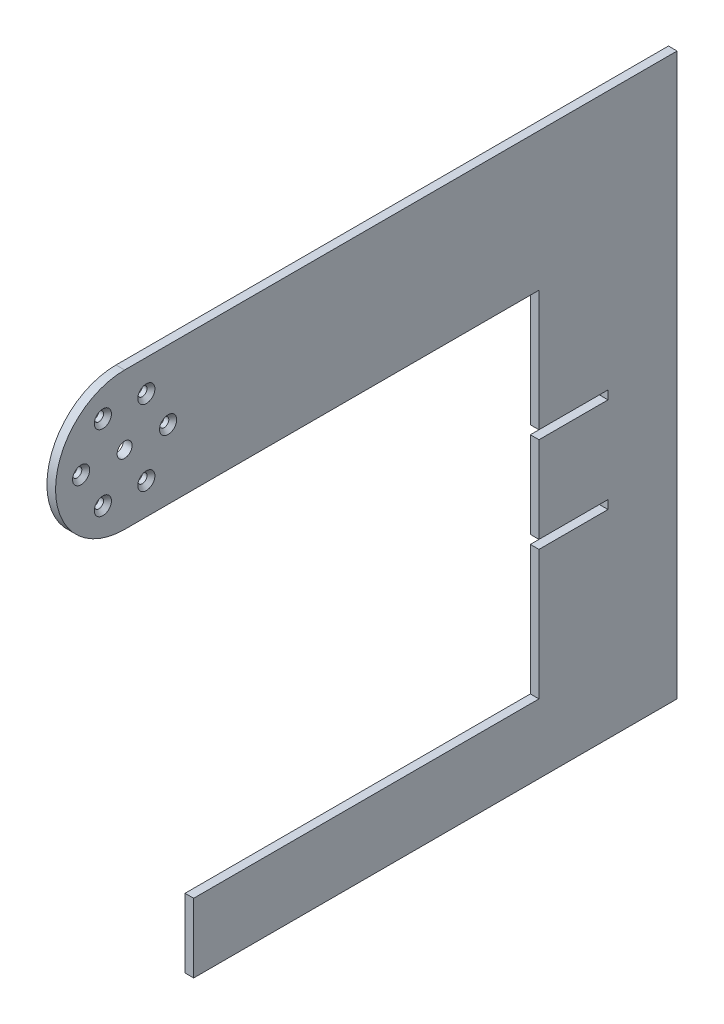
ISO-10303-21;
HEADER;
FILE_DESCRIPTION(('STEP AP214'),'2;1');
FILE_NAME('part.step','',(''),(''),'','','');
FILE_SCHEMA(('AUTOMOTIVE_DESIGN { 1 0 10303 214 1 1 1 1 }'));
ENDSEC;
DATA;
#1=APPLICATION_CONTEXT('core data for automotive mechanical design processes');
#2=APPLICATION_PROTOCOL_DEFINITION('international standard','automotive_design',2000,#1);
#3=PRODUCT_CONTEXT('',#1,'mechanical');
#4=PRODUCT('Part','Part','',(#3));
#5=PRODUCT_RELATED_PRODUCT_CATEGORY('part','',(#4));
#6=PRODUCT_DEFINITION_FORMATION('','',#4);
#7=PRODUCT_DEFINITION_CONTEXT('part definition',#1,'design');
#8=PRODUCT_DEFINITION('design','',#6,#7);
#9=PRODUCT_DEFINITION_SHAPE('','',#8);
#10=(LENGTH_UNIT() NAMED_UNIT(*) SI_UNIT(.MILLI.,.METRE.));
#11=(NAMED_UNIT(*) PLANE_ANGLE_UNIT() SI_UNIT($,.RADIAN.));
#12=(NAMED_UNIT(*) SI_UNIT($,.STERADIAN.) SOLID_ANGLE_UNIT());
#13=UNCERTAINTY_MEASURE_WITH_UNIT(LENGTH_MEASURE(1.E-05),#10,'distance_accuracy_value','');
#14=(GEOMETRIC_REPRESENTATION_CONTEXT(3) GLOBAL_UNCERTAINTY_ASSIGNED_CONTEXT((#13)) GLOBAL_UNIT_ASSIGNED_CONTEXT((#10,
#11,#12)) REPRESENTATION_CONTEXT('',''));
#15=CARTESIAN_POINT('',(0.,0.,0.));
#16=DIRECTION('',(0.,0.,1.));
#17=DIRECTION('',(1.,0.,0.));
#18=AXIS2_PLACEMENT_3D('',#15,#16,#17);
#19=CARTESIAN_POINT('',(-3.175,52.3875,50.8));
#20=DIRECTION('',(0.,0.,1.));
#21=DIRECTION('',(0.,-1.,0.));
#22=AXIS2_PLACEMENT_3D('',#19,#20,#21);
#23=PLANE('',#22);
#24=DIRECTION('',(1.,0.,0.));
#25=VECTOR('',#24,1.);
#26=CARTESIAN_POINT('',(-3.175,7.93750000000001,50.8));
#27=LINE('',#26,#25);
#28=CARTESIAN_POINT('',(-3.175,7.93750000000001,50.8));
#29=VERTEX_POINT('',#28);
#30=CARTESIAN_POINT('',(0.,7.93750000000001,50.8));
#31=VERTEX_POINT('',#30);
#32=EDGE_CURVE('E206',#29,#31,#27,.T.);
#33=ORIENTED_EDGE('',*,*,#32,.T.);
#34=DIRECTION('',(0.,-1.,0.));
#35=VECTOR('',#34,1.);
#36=CARTESIAN_POINT('',(0.,52.3875,50.8));
#37=LINE('',#36,#35);
#38=CARTESIAN_POINT('',(0.,52.3875,50.8));
#39=VERTEX_POINT('',#38);
#40=EDGE_CURVE('E213',#39,#31,#37,.T.);
#41=ORIENTED_EDGE('',*,*,#40,.F.);
#42=DIRECTION('',(1.,0.,0.));
#43=VECTOR('',#42,1.);
#44=CARTESIAN_POINT('',(-3.175,52.3875,50.8));
#45=LINE('',#44,#43);
#46=CARTESIAN_POINT('',(-3.175,52.3875,50.8));
#47=VERTEX_POINT('',#46);
#48=EDGE_CURVE('E238',#47,#39,#45,.T.);
#49=ORIENTED_EDGE('',*,*,#48,.F.);
#50=DIRECTION('',(0.,-1.,0.));
#51=VECTOR('',#50,1.);
#52=CARTESIAN_POINT('',(-3.175,52.3875,50.8));
#53=LINE('',#52,#51);
#54=EDGE_CURVE('E183',#47,#29,#53,.T.);
#55=ORIENTED_EDGE('',*,*,#54,.T.);
#56=EDGE_LOOP('',(#33,#41,#49,#55));
#57=FACE_BOUND('',#56,.T.);
#58=ADVANCED_FACE('F44',(#57),#23,.T.);
#59=DIRECTION('',(1.,0.,0.));
#60=VECTOR('',#59,1.);
#61=CARTESIAN_POINT('',(-3.175,4.76250000000001,50.8));
#62=LINE('',#61,#60);
#63=CARTESIAN_POINT('',(-3.175,4.76250000000001,50.8));
#64=VERTEX_POINT('',#63);
#65=CARTESIAN_POINT('',(0.,4.7625,50.8));
#66=VERTEX_POINT('',#65);
#67=EDGE_CURVE('E69',#64,#66,#62,.T.);
#68=ORIENTED_EDGE('',*,*,#67,.F.);
#69=CARTESIAN_POINT('',(-3.175,-26.9875,50.8));
#70=VERTEX_POINT('',#69);
#71=EDGE_CURVE('E173',#64,#70,#53,.T.);
#72=ORIENTED_EDGE('',*,*,#71,.T.);
#73=DIRECTION('',(1.,0.,0.));
#74=VECTOR('',#73,1.);
#75=CARTESIAN_POINT('',(-3.175,-26.9875,50.8));
#76=LINE('',#75,#74);
#77=CARTESIAN_POINT('',(0.,-26.9875,50.8));
#78=VERTEX_POINT('',#77);
#79=EDGE_CURVE('E277',#70,#78,#76,.T.);
#80=ORIENTED_EDGE('',*,*,#79,.T.);
#81=EDGE_CURVE('E175',#66,#78,#37,.T.);
#82=ORIENTED_EDGE('',*,*,#81,.F.);
#83=EDGE_LOOP('',(#68,#72,#80,#82));
#84=FACE_BOUND('',#83,.T.);
#85=ADVANCED_FACE('F171',(#84),#23,.T.);
#86=CARTESIAN_POINT('',(-3.175,103.1875,0.));
#87=DIRECTION('',(0.,1.,0.));
#88=DIRECTION('',(0.,0.,1.));
#89=AXIS2_PLACEMENT_3D('',#86,#87,#88);
#90=PLANE('',#89);
#91=DIRECTION('',(0.,0.,1.));
#92=VECTOR('',#91,1.);
#93=CARTESIAN_POINT('',(0.,103.1875,0.));
#94=LINE('',#93,#92);
#95=CARTESIAN_POINT('',(0.,103.1875,0.));
#96=VERTEX_POINT('',#95);
#97=CARTESIAN_POINT('',(0.,103.1875,203.2));
#98=VERTEX_POINT('',#97);
#99=EDGE_CURVE('E202',#96,#98,#94,.T.);
#100=ORIENTED_EDGE('',*,*,#99,.F.);
#101=DIRECTION('',(1.,0.,0.));
#102=VECTOR('',#101,1.);
#103=CARTESIAN_POINT('',(-3.175,103.1875,0.));
#104=LINE('',#103,#102);
#105=CARTESIAN_POINT('',(-3.175,103.1875,0.));
#106=VERTEX_POINT('',#105);
#107=EDGE_CURVE('E11',#106,#96,#104,.T.);
#108=ORIENTED_EDGE('',*,*,#107,.F.);
#109=DIRECTION('',(0.,0.,1.));
#110=VECTOR('',#109,1.);
#111=CARTESIAN_POINT('',(-3.175,103.1875,0.));
#112=LINE('',#111,#110);
#113=CARTESIAN_POINT('',(-3.175,103.1875,203.2));
#114=VERTEX_POINT('',#113);
#115=EDGE_CURVE('E227',#106,#114,#112,.T.);
#116=ORIENTED_EDGE('',*,*,#115,.T.);
#117=DIRECTION('',(1.,0.,0.));
#118=VECTOR('',#117,1.);
#119=CARTESIAN_POINT('',(-3.175,103.1875,203.2));
#120=LINE('',#119,#118);
#121=EDGE_CURVE('E48',#114,#98,#120,.T.);
#122=ORIENTED_EDGE('',*,*,#121,.T.);
#123=EDGE_LOOP('',(#100,#108,#116,#122));
#124=FACE_BOUND('',#123,.T.);
#125=ADVANCED_FACE('F46',(#124),#90,.T.);
#126=CARTESIAN_POINT('',(-3.175,-103.1875,0.));
#127=DIRECTION('',(0.,0.,-1.));
#128=DIRECTION('',(0.,1.,0.));
#129=AXIS2_PLACEMENT_3D('',#126,#127,#128);
#130=PLANE('',#129);
#131=DIRECTION('',(0.,1.,0.));
#132=VECTOR('',#131,1.);
#133=CARTESIAN_POINT('',(0.,-103.1875,0.));
#134=LINE('',#133,#132);
#135=CARTESIAN_POINT('',(0.,-103.1875,0.));
#136=VERTEX_POINT('',#135);
#137=EDGE_CURVE('E225',#136,#96,#134,.T.);
#138=ORIENTED_EDGE('',*,*,#137,.F.);
#139=DIRECTION('',(1.,0.,0.));
#140=VECTOR('',#139,1.);
#141=CARTESIAN_POINT('',(-3.175,-103.1875,0.));
#142=LINE('',#141,#140);
#143=CARTESIAN_POINT('',(-3.175,-103.1875,0.));
#144=VERTEX_POINT('',#143);
#145=EDGE_CURVE('E53',#144,#136,#142,.T.);
#146=ORIENTED_EDGE('',*,*,#145,.F.);
#147=DIRECTION('',(0.,1.,0.));
#148=VECTOR('',#147,1.);
#149=CARTESIAN_POINT('',(-3.175,-103.1875,0.));
#150=LINE('',#149,#148);
#151=EDGE_CURVE('E199',#144,#106,#150,.T.);
#152=ORIENTED_EDGE('',*,*,#151,.T.);
#153=ORIENTED_EDGE('',*,*,#107,.T.);
#154=EDGE_LOOP('',(#138,#146,#152,#153));
#155=FACE_BOUND('',#154,.T.);
#156=ADVANCED_FACE('F256',(#155),#130,.T.);
#157=CARTESIAN_POINT('',(-3.175,-103.1875,50.8));
#158=DIRECTION('',(0.,-1.,0.));
#159=DIRECTION('',(0.,0.,-1.));
#160=AXIS2_PLACEMENT_3D('',#157,#158,#159);
#161=PLANE('',#160);
#162=DIRECTION('',(0.,0.,-1.));
#163=VECTOR('',#162,1.);
#164=CARTESIAN_POINT('',(0.,-103.1875,50.8));
#165=LINE('',#164,#163);
#166=CARTESIAN_POINT('',(0.,-103.1875,177.8));
#167=VERTEX_POINT('',#166);
#168=EDGE_CURVE('E222',#167,#136,#165,.T.);
#169=ORIENTED_EDGE('',*,*,#168,.F.);
#170=DIRECTION('',(1.,0.,0.));
#171=VECTOR('',#170,1.);
#172=CARTESIAN_POINT('',(-3.175,-103.1875,177.8));
#173=LINE('',#172,#171);
#174=CARTESIAN_POINT('',(-3.175,-103.1875,177.8));
#175=VERTEX_POINT('',#174);
#176=EDGE_CURVE('E230',#175,#167,#173,.T.);
#177=ORIENTED_EDGE('',*,*,#176,.F.);
#178=DIRECTION('',(0.,0.,-1.));
#179=VECTOR('',#178,1.);
#180=CARTESIAN_POINT('',(-3.175,-103.1875,177.8));
#181=LINE('',#180,#179);
#182=EDGE_CURVE('E197',#175,#144,#181,.T.);
#183=ORIENTED_EDGE('',*,*,#182,.T.);
#184=ORIENTED_EDGE('',*,*,#145,.T.);
#185=EDGE_LOOP('',(#169,#177,#183,#184));
#186=FACE_BOUND('',#185,.T.);
#187=ADVANCED_FACE('F451',(#186),#161,.T.);
#188=CARTESIAN_POINT('',(-3.175,-77.7875,177.8));
#189=DIRECTION('',(0.,0.,1.));
#190=DIRECTION('',(1.,0.,0.));
#191=AXIS2_PLACEMENT_3D('',#188,#189,#190);
#192=PLANE('',#191);
#193=DIRECTION('',(0.,-1.,0.));
#194=VECTOR('',#193,1.);
#195=CARTESIAN_POINT('',(0.,-77.7875,177.8));
#196=LINE('',#195,#194);
#197=CARTESIAN_POINT('',(0.,-77.7875,177.8));
#198=VERTEX_POINT('',#197);
#199=EDGE_CURVE('E219',#198,#167,#196,.T.);
#200=ORIENTED_EDGE('',*,*,#199,.F.);
#201=DIRECTION('',(1.,0.,0.));
#202=VECTOR('',#201,1.);
#203=CARTESIAN_POINT('',(-3.175,-77.7875,177.8));
#204=LINE('',#203,#202);
#205=CARTESIAN_POINT('',(-3.175,-77.7875,177.8));
#206=VERTEX_POINT('',#205);
#207=EDGE_CURVE('E233',#206,#198,#204,.T.);
#208=ORIENTED_EDGE('',*,*,#207,.F.);
#209=DIRECTION('',(0.,-1.,0.));
#210=VECTOR('',#209,1.);
#211=CARTESIAN_POINT('',(-3.175,-77.7875,177.8));
#212=LINE('',#211,#210);
#213=EDGE_CURVE('E194',#206,#175,#212,.T.);
#214=ORIENTED_EDGE('',*,*,#213,.T.);
#215=ORIENTED_EDGE('',*,*,#176,.T.);
#216=EDGE_LOOP('',(#200,#208,#214,#215));
#217=FACE_BOUND('',#216,.T.);
#218=ADVANCED_FACE('F413',(#217),#192,.T.);
#219=CARTESIAN_POINT('',(-3.175,-77.7875,50.8));
#220=DIRECTION('',(0.,1.,0.));
#221=DIRECTION('',(0.,0.,1.));
#222=AXIS2_PLACEMENT_3D('',#219,#220,#221);
#223=PLANE('',#222);
#224=DIRECTION('',(0.,0.,1.));
#225=VECTOR('',#224,1.);
#226=CARTESIAN_POINT('',(0.,-77.7875,50.8));
#227=LINE('',#226,#225);
#228=CARTESIAN_POINT('',(0.,-77.7875,50.8));
#229=VERTEX_POINT('',#228);
#230=EDGE_CURVE('E216',#229,#198,#227,.T.);
#231=ORIENTED_EDGE('',*,*,#230,.F.);
#232=DIRECTION('',(1.,0.,0.));
#233=VECTOR('',#232,1.);
#234=CARTESIAN_POINT('',(-3.175,-77.7875,50.8));
#235=LINE('',#234,#233);
#236=CARTESIAN_POINT('',(-3.175,-77.7875,50.8));
#237=VERTEX_POINT('',#236);
#238=EDGE_CURVE('E235',#237,#229,#235,.T.);
#239=ORIENTED_EDGE('',*,*,#238,.F.);
#240=DIRECTION('',(0.,0.,1.));
#241=VECTOR('',#240,1.);
#242=CARTESIAN_POINT('',(-3.175,-77.7875,50.8));
#243=LINE('',#242,#241);
#244=EDGE_CURVE('E187',#237,#206,#243,.T.);
#245=ORIENTED_EDGE('',*,*,#244,.T.);
#246=ORIENTED_EDGE('',*,*,#207,.T.);
#247=EDGE_LOOP('',(#231,#239,#245,#246));
#248=FACE_BOUND('',#247,.T.);
#249=ADVANCED_FACE('F405',(#248),#223,.T.);
#250=DIRECTION('',(1.,0.,0.));
#251=VECTOR('',#250,1.);
#252=CARTESIAN_POINT('',(-3.175,-30.1625,50.8));
#253=LINE('',#252,#251);
#254=CARTESIAN_POINT('',(-3.175,-30.1625,50.8));
#255=VERTEX_POINT('',#254);
#256=CARTESIAN_POINT('',(0.,-30.1625,50.8));
#257=VERTEX_POINT('',#256);
#258=EDGE_CURVE('E61',#255,#257,#253,.T.);
#259=ORIENTED_EDGE('',*,*,#258,.F.);
#260=EDGE_CURVE('E184',#255,#237,#53,.T.);
#261=ORIENTED_EDGE('',*,*,#260,.T.);
#262=ORIENTED_EDGE('',*,*,#238,.T.);
#263=EDGE_CURVE('E212',#257,#229,#37,.T.);
#264=ORIENTED_EDGE('',*,*,#263,.F.);
#265=EDGE_LOOP('',(#259,#261,#262,#264));
#266=FACE_BOUND('',#265,.T.);
#267=ADVANCED_FACE('F396',(#266),#23,.T.);
#268=CARTESIAN_POINT('',(-3.175,52.3875,203.2));
#269=DIRECTION('',(0.,-1.,0.));
#270=DIRECTION('',(0.,0.,-1.));
#271=AXIS2_PLACEMENT_3D('',#268,#269,#270);
#272=PLANE('',#271);
#273=DIRECTION('',(0.,0.,-1.));
#274=VECTOR('',#273,1.);
#275=CARTESIAN_POINT('',(0.,52.3875,203.2));
#276=LINE('',#275,#274);
#277=CARTESIAN_POINT('',(0.,52.3875,203.2));
#278=VERTEX_POINT('',#277);
#279=EDGE_CURVE('E209',#278,#39,#276,.T.);
#280=ORIENTED_EDGE('',*,*,#279,.F.);
#281=DIRECTION('',(1.,0.,0.));
#282=VECTOR('',#281,1.);
#283=CARTESIAN_POINT('',(-3.175,52.3875,203.2));
#284=LINE('',#283,#282);
#285=CARTESIAN_POINT('',(-3.175,52.3875,203.2));
#286=VERTEX_POINT('',#285);
#287=EDGE_CURVE('E239',#286,#278,#284,.T.);
#288=ORIENTED_EDGE('',*,*,#287,.F.);
#289=DIRECTION('',(0.,0.,-1.));
#290=VECTOR('',#289,1.);
#291=CARTESIAN_POINT('',(-3.175,52.3875,203.2));
#292=LINE('',#291,#290);
#293=EDGE_CURVE('E188',#286,#47,#292,.T.);
#294=ORIENTED_EDGE('',*,*,#293,.T.);
#295=ORIENTED_EDGE('',*,*,#48,.T.);
#296=EDGE_LOOP('',(#280,#288,#294,#295));
#297=FACE_BOUND('',#296,.T.);
#298=ADVANCED_FACE('F404',(#297),#272,.T.);
#299=CARTESIAN_POINT('',(-3.175,77.7875,203.2));
#300=DIRECTION('',(1.,0.,0.));
#301=DIRECTION('',(0.,0.,-1.));
#302=AXIS2_PLACEMENT_3D('',#299,#300,#301);
#303=CYLINDRICAL_SURFACE('',#302,25.4);
#304=CARTESIAN_POINT('',(0.,77.7875,203.2));
#305=DIRECTION('',(1.,0.,0.));
#306=DIRECTION('',(0.,0.,-1.));
#307=AXIS2_PLACEMENT_3D('',#304,#305,#306);
#308=CIRCLE('',#307,25.4);
#309=EDGE_CURVE('E205',#98,#278,#308,.T.);
#310=ORIENTED_EDGE('',*,*,#309,.F.);
#311=ORIENTED_EDGE('',*,*,#121,.F.);
#312=CARTESIAN_POINT('',(-3.175,77.7875,203.2));
#313=DIRECTION('',(1.,0.,0.));
#314=DIRECTION('',(0.,0.,-1.));
#315=AXIS2_PLACEMENT_3D('',#312,#313,#314);
#316=CIRCLE('',#315,25.4);
#317=EDGE_CURVE('E260',#114,#286,#316,.T.);
#318=ORIENTED_EDGE('',*,*,#317,.T.);
#319=ORIENTED_EDGE('',*,*,#287,.T.);
#320=EDGE_LOOP('',(#310,#311,#318,#319));
#321=FACE_BOUND('',#320,.T.);
#322=ADVANCED_FACE('F249',(#321),#303,.T.);
#323=CARTESIAN_POINT('',(-3.175,77.7875,203.2));
#324=DIRECTION('',(1.,0.,0.));
#325=DIRECTION('',(0.,0.,-1.));
#326=AXIS2_PLACEMENT_3D('',#323,#324,#325);
#327=PLANE('',#326);
#328=CARTESIAN_POINT('',(-3.175,77.7875,219.2));
#329=DIRECTION('',(1.,0.,0.));
#330=DIRECTION('',(0.,0.,-1.));
#331=AXIS2_PLACEMENT_3D('',#328,#329,#330);
#332=CIRCLE('',#331,1.69999999999999);
#333=CARTESIAN_POINT('',(-3.175,77.7875,217.5));
#334=VERTEX_POINT('',#333);
#335=EDGE_CURVE('E348',#334,#334,#332,.T.);
#336=ORIENTED_EDGE('',*,*,#335,.T.);
#337=EDGE_LOOP('',(#336));
#338=FACE_BOUND('',#337,.T.);
#339=CARTESIAN_POINT('',(-3.175,91.643906460551,211.2));
#340=DIRECTION('',(1.,0.,0.));
#341=DIRECTION('',(0.,0.,-1.));
#342=AXIS2_PLACEMENT_3D('',#339,#340,#341);
#343=CIRCLE('',#342,1.69999999999999);
#344=CARTESIAN_POINT('',(-3.175,91.643906460551,209.5));
#345=VERTEX_POINT('',#344);
#346=EDGE_CURVE('E339',#345,#345,#343,.T.);
#347=ORIENTED_EDGE('',*,*,#346,.T.);
#348=EDGE_LOOP('',(#347));
#349=FACE_BOUND('',#348,.T.);
#350=CARTESIAN_POINT('',(-3.175,91.643906460551,195.2));
#351=DIRECTION('',(1.,0.,0.));
#352=DIRECTION('',(0.,0.,-1.));
#353=AXIS2_PLACEMENT_3D('',#350,#351,#352);
#354=CIRCLE('',#353,1.69999999999999);
#355=CARTESIAN_POINT('',(-3.175,91.643906460551,193.5));
#356=VERTEX_POINT('',#355);
#357=EDGE_CURVE('E330',#356,#356,#354,.T.);
#358=ORIENTED_EDGE('',*,*,#357,.T.);
#359=EDGE_LOOP('',(#358));
#360=FACE_BOUND('',#359,.T.);
#361=CARTESIAN_POINT('',(-3.175,77.7874999999999,187.2));
#362=DIRECTION('',(1.,0.,0.));
#363=DIRECTION('',(0.,0.,-1.));
#364=AXIS2_PLACEMENT_3D('',#361,#362,#363);
#365=CIRCLE('',#364,1.69999999999999);
#366=CARTESIAN_POINT('',(-3.175,77.7874999999999,185.5));
#367=VERTEX_POINT('',#366);
#368=EDGE_CURVE('E321',#367,#367,#365,.T.);
#369=ORIENTED_EDGE('',*,*,#368,.T.);
#370=EDGE_LOOP('',(#369));
#371=FACE_BOUND('',#370,.T.);
#372=CARTESIAN_POINT('',(-3.175,63.931093539449,195.2));
#373=DIRECTION('',(1.,0.,0.));
#374=DIRECTION('',(0.,0.,-1.));
#375=AXIS2_PLACEMENT_3D('',#372,#373,#374);
#376=CIRCLE('',#375,1.69999999999999);
#377=CARTESIAN_POINT('',(-3.175,63.931093539449,193.5));
#378=VERTEX_POINT('',#377);
#379=EDGE_CURVE('E312',#378,#378,#376,.T.);
#380=ORIENTED_EDGE('',*,*,#379,.T.);
#381=EDGE_LOOP('',(#380));
#382=FACE_BOUND('',#381,.T.);
#383=CARTESIAN_POINT('',(-3.175,63.9310935394491,211.2));
#384=DIRECTION('',(1.,0.,0.));
#385=DIRECTION('',(0.,0.,-1.));
#386=AXIS2_PLACEMENT_3D('',#383,#384,#385);
#387=CIRCLE('',#386,1.69999999999999);
#388=CARTESIAN_POINT('',(-3.175,63.9310935394491,209.5));
#389=VERTEX_POINT('',#388);
#390=EDGE_CURVE('E301',#389,#389,#387,.T.);
#391=ORIENTED_EDGE('',*,*,#390,.T.);
#392=EDGE_LOOP('',(#391));
#393=FACE_BOUND('',#392,.T.);
#394=CARTESIAN_POINT('',(-3.175,77.7875,203.2));
#395=DIRECTION('',(1.,0.,0.));
#396=DIRECTION('',(0.,0.,-1.));
#397=AXIS2_PLACEMENT_3D('',#394,#395,#396);
#398=CIRCLE('',#397,2.753999953);
#399=CARTESIAN_POINT('',(-3.175,77.7875,200.446000047));
#400=VERTEX_POINT('',#399);
#401=EDGE_CURVE('E280',#400,#400,#398,.T.);
#402=ORIENTED_EDGE('',*,*,#401,.T.);
#403=EDGE_LOOP('',(#402));
#404=FACE_BOUND('',#403,.T.);
#405=DIRECTION('',(0.,1.,0.));
#406=VECTOR('',#405,1.);
#407=CARTESIAN_POINT('',(-3.175,4.76250000000001,25.4));
#408=LINE('',#407,#406);
#409=CARTESIAN_POINT('',(-3.175,4.76250000000001,25.4));
#410=VERTEX_POINT('',#409);
#411=CARTESIAN_POINT('',(-3.175,7.93750000000001,25.4));
#412=VERTEX_POINT('',#411);
#413=EDGE_CURVE('E165',#410,#412,#408,.T.);
#414=ORIENTED_EDGE('',*,*,#413,.T.);
#415=DIRECTION('',(0.,0.,1.));
#416=VECTOR('',#415,1.);
#417=CARTESIAN_POINT('',(-3.175,7.93750000000001,25.4));
#418=LINE('',#417,#416);
#419=EDGE_CURVE('E176',#412,#29,#418,.T.);
#420=ORIENTED_EDGE('',*,*,#419,.T.);
#421=ORIENTED_EDGE('',*,*,#54,.F.);
#422=ORIENTED_EDGE('',*,*,#293,.F.);
#423=ORIENTED_EDGE('',*,*,#317,.F.);
#424=ORIENTED_EDGE('',*,*,#115,.F.);
#425=ORIENTED_EDGE('',*,*,#151,.F.);
#426=ORIENTED_EDGE('',*,*,#182,.F.);
#427=ORIENTED_EDGE('',*,*,#213,.F.);
#428=ORIENTED_EDGE('',*,*,#244,.F.);
#429=ORIENTED_EDGE('',*,*,#260,.F.);
#430=DIRECTION('',(0.,0.,-1.));
#431=VECTOR('',#430,1.);
#432=CARTESIAN_POINT('',(-3.175,-30.1625,25.4));
#433=LINE('',#432,#431);
#434=CARTESIAN_POINT('',(-3.175,-30.1625,25.4));
#435=VERTEX_POINT('',#434);
#436=EDGE_CURVE('E263',#255,#435,#433,.T.);
#437=ORIENTED_EDGE('',*,*,#436,.T.);
#438=DIRECTION('',(0.,1.,0.));
#439=VECTOR('',#438,1.);
#440=CARTESIAN_POINT('',(-3.175,-26.9875,25.4));
#441=LINE('',#440,#439);
#442=CARTESIAN_POINT('',(-3.175,-26.9875,25.4));
#443=VERTEX_POINT('',#442);
#444=EDGE_CURVE('E267',#435,#443,#441,.T.);
#445=ORIENTED_EDGE('',*,*,#444,.T.);
#446=DIRECTION('',(0.,0.,1.));
#447=VECTOR('',#446,1.);
#448=CARTESIAN_POINT('',(-3.175,-26.9875,50.8));
#449=LINE('',#448,#447);
#450=EDGE_CURVE('E182',#443,#70,#449,.T.);
#451=ORIENTED_EDGE('',*,*,#450,.T.);
#452=ORIENTED_EDGE('',*,*,#71,.F.);
#453=DIRECTION('',(0.,0.,-1.));
#454=VECTOR('',#453,1.);
#455=CARTESIAN_POINT('',(-3.175,4.76250000000001,50.8));
#456=LINE('',#455,#454);
#457=EDGE_CURVE('E158',#64,#410,#456,.T.);
#458=ORIENTED_EDGE('',*,*,#457,.T.);
#459=EDGE_LOOP('',(#414,#420,#421,#422,#423,#424,#425,#426,#427,#428,#429,#437,#445,#451,#452,#458));
#460=FACE_BOUND('',#459,.T.);
#461=ADVANCED_FACE('F179',(#338,#349,#360,#371,#382,#393,#404,#460),#327,.F.);
#462=CARTESIAN_POINT('',(0.,77.7875,203.2));
#463=DIRECTION('',(1.,0.,0.));
#464=DIRECTION('',(0.,0.,-1.));
#465=AXIS2_PLACEMENT_3D('',#462,#463,#464);
#466=PLANE('',#465);
#467=CARTESIAN_POINT('',(0.,77.7875,219.2));
#468=DIRECTION('',(1.,0.,0.));
#469=DIRECTION('',(0.,0.,-1.));
#470=AXIS2_PLACEMENT_3D('',#467,#468,#469);
#471=CIRCLE('',#470,3.15);
#472=CARTESIAN_POINT('',(0.,77.7875,216.05));
#473=VERTEX_POINT('',#472);
#474=EDGE_CURVE('E354',#473,#473,#471,.T.);
#475=ORIENTED_EDGE('',*,*,#474,.F.);
#476=EDGE_LOOP('',(#475));
#477=FACE_BOUND('',#476,.T.);
#478=CARTESIAN_POINT('',(0.,91.643906460551,211.2));
#479=DIRECTION('',(1.,0.,0.));
#480=DIRECTION('',(0.,0.,-1.));
#481=AXIS2_PLACEMENT_3D('',#478,#479,#480);
#482=CIRCLE('',#481,3.15);
#483=CARTESIAN_POINT('',(0.,91.643906460551,208.05));
#484=VERTEX_POINT('',#483);
#485=EDGE_CURVE('E345',#484,#484,#482,.T.);
#486=ORIENTED_EDGE('',*,*,#485,.F.);
#487=EDGE_LOOP('',(#486));
#488=FACE_BOUND('',#487,.T.);
#489=CARTESIAN_POINT('',(0.,91.643906460551,195.2));
#490=DIRECTION('',(1.,0.,0.));
#491=DIRECTION('',(0.,0.,-1.));
#492=AXIS2_PLACEMENT_3D('',#489,#490,#491);
#493=CIRCLE('',#492,3.15);
#494=CARTESIAN_POINT('',(0.,91.643906460551,192.05));
#495=VERTEX_POINT('',#494);
#496=EDGE_CURVE('E336',#495,#495,#493,.T.);
#497=ORIENTED_EDGE('',*,*,#496,.F.);
#498=EDGE_LOOP('',(#497));
#499=FACE_BOUND('',#498,.T.);
#500=CARTESIAN_POINT('',(0.,77.7874999999999,187.2));
#501=DIRECTION('',(1.,0.,0.));
#502=DIRECTION('',(0.,0.,-1.));
#503=AXIS2_PLACEMENT_3D('',#500,#501,#502);
#504=CIRCLE('',#503,3.15);
#505=CARTESIAN_POINT('',(0.,77.7874999999999,184.05));
#506=VERTEX_POINT('',#505);
#507=EDGE_CURVE('E327',#506,#506,#504,.T.);
#508=ORIENTED_EDGE('',*,*,#507,.F.);
#509=EDGE_LOOP('',(#508));
#510=FACE_BOUND('',#509,.T.);
#511=CARTESIAN_POINT('',(0.,63.931093539449,195.2));
#512=DIRECTION('',(1.,0.,0.));
#513=DIRECTION('',(0.,0.,-1.));
#514=AXIS2_PLACEMENT_3D('',#511,#512,#513);
#515=CIRCLE('',#514,3.15);
#516=CARTESIAN_POINT('',(0.,63.931093539449,192.05));
#517=VERTEX_POINT('',#516);
#518=EDGE_CURVE('E318',#517,#517,#515,.T.);
#519=ORIENTED_EDGE('',*,*,#518,.F.);
#520=EDGE_LOOP('',(#519));
#521=FACE_BOUND('',#520,.T.);
#522=CARTESIAN_POINT('',(0.,63.9310935394491,211.2));
#523=DIRECTION('',(1.,0.,0.));
#524=DIRECTION('',(0.,0.,-1.));
#525=AXIS2_PLACEMENT_3D('',#522,#523,#524);
#526=CIRCLE('',#525,3.15);
#527=CARTESIAN_POINT('',(0.,63.9310935394491,208.05));
#528=VERTEX_POINT('',#527);
#529=EDGE_CURVE('E309',#528,#528,#526,.T.);
#530=ORIENTED_EDGE('',*,*,#529,.F.);
#531=EDGE_LOOP('',(#530));
#532=FACE_BOUND('',#531,.T.);
#533=CARTESIAN_POINT('',(0.,77.7875,203.2));
#534=DIRECTION('',(1.,0.,0.));
#535=DIRECTION('',(0.,0.,-1.));
#536=AXIS2_PLACEMENT_3D('',#533,#534,#535);
#537=CIRCLE('',#536,2.753999953);
#538=CARTESIAN_POINT('',(0.,77.7875,200.446000047));
#539=VERTEX_POINT('',#538);
#540=EDGE_CURVE('E298',#539,#539,#537,.T.);
#541=ORIENTED_EDGE('',*,*,#540,.F.);
#542=EDGE_LOOP('',(#541));
#543=FACE_BOUND('',#542,.T.);
#544=DIRECTION('',(0.,0.,1.));
#545=VECTOR('',#544,1.);
#546=CARTESIAN_POINT('',(0.,7.93750000000001,25.4));
#547=LINE('',#546,#545);
#548=CARTESIAN_POINT('',(0.,7.93750000000001,25.4));
#549=VERTEX_POINT('',#548);
#550=EDGE_CURVE('E166',#549,#31,#547,.T.);
#551=ORIENTED_EDGE('',*,*,#550,.F.);
#552=DIRECTION('',(0.,1.,0.));
#553=VECTOR('',#552,1.);
#554=CARTESIAN_POINT('',(0.,4.76250000000001,25.4));
#555=LINE('',#554,#553);
#556=CARTESIAN_POINT('',(0.,4.76250000000001,25.4));
#557=VERTEX_POINT('',#556);
#558=EDGE_CURVE('E291',#557,#549,#555,.T.);
#559=ORIENTED_EDGE('',*,*,#558,.F.);
#560=DIRECTION('',(0.,0.,-1.));
#561=VECTOR('',#560,1.);
#562=CARTESIAN_POINT('',(0.,4.76250000000001,50.8));
#563=LINE('',#562,#561);
#564=EDGE_CURVE('E272',#66,#557,#563,.T.);
#565=ORIENTED_EDGE('',*,*,#564,.F.);
#566=ORIENTED_EDGE('',*,*,#81,.T.);
#567=DIRECTION('',(0.,0.,1.));
#568=VECTOR('',#567,1.);
#569=CARTESIAN_POINT('',(0.,-26.9875,50.8));
#570=LINE('',#569,#568);
#571=CARTESIAN_POINT('',(0.,-26.9875,25.4));
#572=VERTEX_POINT('',#571);
#573=EDGE_CURVE('E266',#572,#78,#570,.T.);
#574=ORIENTED_EDGE('',*,*,#573,.F.);
#575=DIRECTION('',(0.,1.,0.));
#576=VECTOR('',#575,1.);
#577=CARTESIAN_POINT('',(0.,-26.9875,25.4));
#578=LINE('',#577,#576);
#579=CARTESIAN_POINT('',(0.,-30.1625,25.4));
#580=VERTEX_POINT('',#579);
#581=EDGE_CURVE('E273',#580,#572,#578,.T.);
#582=ORIENTED_EDGE('',*,*,#581,.F.);
#583=DIRECTION('',(0.,0.,-1.));
#584=VECTOR('',#583,1.);
#585=CARTESIAN_POINT('',(0.,-30.1625,25.4));
#586=LINE('',#585,#584);
#587=EDGE_CURVE('E270',#257,#580,#586,.T.);
#588=ORIENTED_EDGE('',*,*,#587,.F.);
#589=ORIENTED_EDGE('',*,*,#263,.T.);
#590=ORIENTED_EDGE('',*,*,#230,.T.);
#591=ORIENTED_EDGE('',*,*,#199,.T.);
#592=ORIENTED_EDGE('',*,*,#168,.T.);
#593=ORIENTED_EDGE('',*,*,#137,.T.);
#594=ORIENTED_EDGE('',*,*,#99,.T.);
#595=ORIENTED_EDGE('',*,*,#309,.T.);
#596=ORIENTED_EDGE('',*,*,#279,.T.);
#597=ORIENTED_EDGE('',*,*,#40,.T.);
#598=EDGE_LOOP('',(#551,#559,#565,#566,#574,#582,#588,#589,#590,#591,#592,#593,#594,#595,#596,#597));
#599=FACE_BOUND('',#598,.T.);
#600=ADVANCED_FACE('F252',(#477,#488,#499,#510,#521,#532,#543,#599),#466,.T.);
#601=CARTESIAN_POINT('',(-3.175,-26.9875,50.8));
#602=DIRECTION('',(0.,1.,0.));
#603=DIRECTION('',(0.,0.,1.));
#604=AXIS2_PLACEMENT_3D('',#601,#602,#603);
#605=PLANE('',#604);
#606=ORIENTED_EDGE('',*,*,#573,.T.);
#607=ORIENTED_EDGE('',*,*,#79,.F.);
#608=ORIENTED_EDGE('',*,*,#450,.F.);
#609=DIRECTION('',(1.,0.,0.));
#610=VECTOR('',#609,1.);
#611=CARTESIAN_POINT('',(-3.175,-26.9875,25.4));
#612=LINE('',#611,#610);
#613=EDGE_CURVE('E279',#443,#572,#612,.T.);
#614=ORIENTED_EDGE('',*,*,#613,.T.);
#615=EDGE_LOOP('',(#606,#607,#608,#614));
#616=FACE_BOUND('',#615,.T.);
#617=ADVANCED_FACE('F362',(#616),#605,.F.);
#618=CARTESIAN_POINT('',(-3.175,-26.9875,25.4));
#619=DIRECTION('',(0.,0.,-1.));
#620=DIRECTION('',(-1.,0.,0.));
#621=AXIS2_PLACEMENT_3D('',#618,#619,#620);
#622=PLANE('',#621);
#623=ORIENTED_EDGE('',*,*,#581,.T.);
#624=ORIENTED_EDGE('',*,*,#613,.F.);
#625=ORIENTED_EDGE('',*,*,#444,.F.);
#626=DIRECTION('',(1.,0.,0.));
#627=VECTOR('',#626,1.);
#628=CARTESIAN_POINT('',(-3.175,-30.1625,25.4));
#629=LINE('',#628,#627);
#630=EDGE_CURVE('E282',#435,#580,#629,.T.);
#631=ORIENTED_EDGE('',*,*,#630,.T.);
#632=EDGE_LOOP('',(#623,#624,#625,#631));
#633=FACE_BOUND('',#632,.T.);
#634=ADVANCED_FACE('F439',(#633),#622,.F.);
#635=CARTESIAN_POINT('',(-3.175,-30.1625,25.4));
#636=DIRECTION('',(0.,-1.,0.));
#637=DIRECTION('',(0.,0.,-1.));
#638=AXIS2_PLACEMENT_3D('',#635,#636,#637);
#639=PLANE('',#638);
#640=ORIENTED_EDGE('',*,*,#587,.T.);
#641=ORIENTED_EDGE('',*,*,#630,.F.);
#642=ORIENTED_EDGE('',*,*,#436,.F.);
#643=ORIENTED_EDGE('',*,*,#258,.T.);
#644=EDGE_LOOP('',(#640,#641,#642,#643));
#645=FACE_BOUND('',#644,.T.);
#646=ADVANCED_FACE('F433',(#645),#639,.F.);
#647=CARTESIAN_POINT('',(-3.175,7.93750000000001,25.4));
#648=DIRECTION('',(0.,1.,0.));
#649=DIRECTION('',(0.,0.,1.));
#650=AXIS2_PLACEMENT_3D('',#647,#648,#649);
#651=PLANE('',#650);
#652=ORIENTED_EDGE('',*,*,#550,.T.);
#653=ORIENTED_EDGE('',*,*,#32,.F.);
#654=ORIENTED_EDGE('',*,*,#419,.F.);
#655=DIRECTION('',(1.,0.,0.));
#656=VECTOR('',#655,1.);
#657=CARTESIAN_POINT('',(-3.175,7.93750000000001,25.4));
#658=LINE('',#657,#656);
#659=EDGE_CURVE('E286',#412,#549,#658,.T.);
#660=ORIENTED_EDGE('',*,*,#659,.T.);
#661=EDGE_LOOP('',(#652,#653,#654,#660));
#662=FACE_BOUND('',#661,.T.);
#663=ADVANCED_FACE('F431',(#662),#651,.F.);
#664=CARTESIAN_POINT('',(-3.175,4.76250000000001,25.4));
#665=DIRECTION('',(0.,0.,-1.));
#666=DIRECTION('',(-1.,0.,0.));
#667=AXIS2_PLACEMENT_3D('',#664,#665,#666);
#668=PLANE('',#667);
#669=ORIENTED_EDGE('',*,*,#558,.T.);
#670=ORIENTED_EDGE('',*,*,#659,.F.);
#671=ORIENTED_EDGE('',*,*,#413,.F.);
#672=DIRECTION('',(1.,0.,0.));
#673=VECTOR('',#672,1.);
#674=CARTESIAN_POINT('',(-3.175,4.76250000000001,25.4));
#675=LINE('',#674,#673);
#676=EDGE_CURVE('E160',#410,#557,#675,.T.);
#677=ORIENTED_EDGE('',*,*,#676,.T.);
#678=EDGE_LOOP('',(#669,#670,#671,#677));
#679=FACE_BOUND('',#678,.T.);
#680=ADVANCED_FACE('F389',(#679),#668,.F.);
#681=CARTESIAN_POINT('',(-3.175,4.76250000000001,50.8));
#682=DIRECTION('',(0.,-1.,0.));
#683=DIRECTION('',(0.,0.,-1.));
#684=AXIS2_PLACEMENT_3D('',#681,#682,#683);
#685=PLANE('',#684);
#686=ORIENTED_EDGE('',*,*,#564,.T.);
#687=ORIENTED_EDGE('',*,*,#676,.F.);
#688=ORIENTED_EDGE('',*,*,#457,.F.);
#689=ORIENTED_EDGE('',*,*,#67,.T.);
#690=EDGE_LOOP('',(#686,#687,#688,#689));
#691=FACE_BOUND('',#690,.T.);
#692=ADVANCED_FACE('F159',(#691),#685,.F.);
#693=CARTESIAN_POINT('',(-3.175,77.7875,203.2));
#694=DIRECTION('',(1.,0.,0.));
#695=DIRECTION('',(0.,0.,-1.));
#696=AXIS2_PLACEMENT_3D('',#693,#694,#695);
#697=CYLINDRICAL_SURFACE('',#696,2.753999953);
#698=ORIENTED_EDGE('',*,*,#401,.F.);
#699=EDGE_LOOP('',(#698));
#700=FACE_BOUND('',#699,.T.);
#701=ORIENTED_EDGE('',*,*,#540,.T.);
#702=EDGE_LOOP('',(#701));
#703=FACE_BOUND('',#702,.T.);
#704=ADVANCED_FACE('F376',(#700,#703),#697,.F.);
#705=CARTESIAN_POINT('',(0.,63.9310935394491,211.2));
#706=DIRECTION('',(1.,0.,0.));
#707=DIRECTION('',(0.,0.,-1.));
#708=AXIS2_PLACEMENT_3D('',#705,#706,#707);
#709=CYLINDRICAL_SURFACE('',#708,1.69999999999999);
#710=ORIENTED_EDGE('',*,*,#390,.F.);
#711=EDGE_LOOP('',(#710));
#712=FACE_BOUND('',#711,.T.);
#713=CARTESIAN_POINT('',(-1.45,63.9310935394491,211.2));
#714=DIRECTION('',(1.,0.,0.));
#715=DIRECTION('',(0.,0.,-1.));
#716=AXIS2_PLACEMENT_3D('',#713,#714,#715);
#717=CIRCLE('',#716,1.69999999999999);
#718=CARTESIAN_POINT('',(-1.45,63.9310935394491,209.5));
#719=VERTEX_POINT('',#718);
#720=EDGE_CURVE('E306',#719,#719,#717,.T.);
#721=ORIENTED_EDGE('',*,*,#720,.T.);
#722=EDGE_LOOP('',(#721));
#723=FACE_BOUND('',#722,.T.);
#724=ADVANCED_FACE('F378',(#712,#723),#709,.F.);
#725=CARTESIAN_POINT('',(0.,63.9310935394491,211.2));
#726=DIRECTION('',(1.,0.,0.));
#727=DIRECTION('',(0.,0.,-1.));
#728=AXIS2_PLACEMENT_3D('',#725,#726,#727);
#729=CONICAL_SURFACE('',#728,3.15,0.785398163397451);
#730=ORIENTED_EDGE('',*,*,#720,.F.);
#731=EDGE_LOOP('',(#730));
#732=FACE_BOUND('',#731,.T.);
#733=ORIENTED_EDGE('',*,*,#529,.T.);
#734=EDGE_LOOP('',(#733));
#735=FACE_BOUND('',#734,.T.);
#736=ADVANCED_FACE('F386',(#732,#735),#729,.F.);
#737=CARTESIAN_POINT('',(0.,63.931093539449,195.2));
#738=DIRECTION('',(1.,0.,0.));
#739=DIRECTION('',(0.,0.,-1.));
#740=AXIS2_PLACEMENT_3D('',#737,#738,#739);
#741=CYLINDRICAL_SURFACE('',#740,1.69999999999999);
#742=ORIENTED_EDGE('',*,*,#379,.F.);
#743=EDGE_LOOP('',(#742));
#744=FACE_BOUND('',#743,.T.);
#745=CARTESIAN_POINT('',(-1.45,63.931093539449,195.2));
#746=DIRECTION('',(1.,0.,0.));
#747=DIRECTION('',(0.,0.,-1.));
#748=AXIS2_PLACEMENT_3D('',#745,#746,#747);
#749=CIRCLE('',#748,1.69999999999999);
#750=CARTESIAN_POINT('',(-1.45,63.931093539449,193.5));
#751=VERTEX_POINT('',#750);
#752=EDGE_CURVE('E315',#751,#751,#749,.T.);
#753=ORIENTED_EDGE('',*,*,#752,.T.);
#754=EDGE_LOOP('',(#753));
#755=FACE_BOUND('',#754,.T.);
#756=ADVANCED_FACE('F563',(#744,#755),#741,.F.);
#757=CARTESIAN_POINT('',(0.,63.931093539449,195.2));
#758=DIRECTION('',(1.,0.,0.));
#759=DIRECTION('',(0.,0.,-1.));
#760=AXIS2_PLACEMENT_3D('',#757,#758,#759);
#761=CONICAL_SURFACE('',#760,3.15,0.785398163397451);
#762=ORIENTED_EDGE('',*,*,#752,.F.);
#763=EDGE_LOOP('',(#762));
#764=FACE_BOUND('',#763,.T.);
#765=ORIENTED_EDGE('',*,*,#518,.T.);
#766=EDGE_LOOP('',(#765));
#767=FACE_BOUND('',#766,.T.);
#768=ADVANCED_FACE('F573',(#764,#767),#761,.F.);
#769=CARTESIAN_POINT('',(0.,77.7874999999999,187.2));
#770=DIRECTION('',(1.,0.,0.));
#771=DIRECTION('',(0.,0.,-1.));
#772=AXIS2_PLACEMENT_3D('',#769,#770,#771);
#773=CYLINDRICAL_SURFACE('',#772,1.69999999999999);
#774=ORIENTED_EDGE('',*,*,#368,.F.);
#775=EDGE_LOOP('',(#774));
#776=FACE_BOUND('',#775,.T.);
#777=CARTESIAN_POINT('',(-1.45,77.7874999999999,187.2));
#778=DIRECTION('',(1.,0.,0.));
#779=DIRECTION('',(0.,0.,-1.));
#780=AXIS2_PLACEMENT_3D('',#777,#778,#779);
#781=CIRCLE('',#780,1.69999999999999);
#782=CARTESIAN_POINT('',(-1.45,77.7874999999999,185.5));
#783=VERTEX_POINT('',#782);
#784=EDGE_CURVE('E324',#783,#783,#781,.T.);
#785=ORIENTED_EDGE('',*,*,#784,.T.);
#786=EDGE_LOOP('',(#785));
#787=FACE_BOUND('',#786,.T.);
#788=ADVANCED_FACE('F583',(#776,#787),#773,.F.);
#789=CARTESIAN_POINT('',(0.,77.7874999999999,187.2));
#790=DIRECTION('',(1.,0.,0.));
#791=DIRECTION('',(0.,0.,-1.));
#792=AXIS2_PLACEMENT_3D('',#789,#790,#791);
#793=CONICAL_SURFACE('',#792,3.15,0.785398163397451);
#794=ORIENTED_EDGE('',*,*,#784,.F.);
#795=EDGE_LOOP('',(#794));
#796=FACE_BOUND('',#795,.T.);
#797=ORIENTED_EDGE('',*,*,#507,.T.);
#798=EDGE_LOOP('',(#797));
#799=FACE_BOUND('',#798,.T.);
#800=ADVANCED_FACE('F593',(#796,#799),#793,.F.);
#801=CARTESIAN_POINT('',(0.,91.643906460551,195.2));
#802=DIRECTION('',(1.,0.,0.));
#803=DIRECTION('',(0.,0.,-1.));
#804=AXIS2_PLACEMENT_3D('',#801,#802,#803);
#805=CYLINDRICAL_SURFACE('',#804,1.69999999999999);
#806=ORIENTED_EDGE('',*,*,#357,.F.);
#807=EDGE_LOOP('',(#806));
#808=FACE_BOUND('',#807,.T.);
#809=CARTESIAN_POINT('',(-1.45,91.643906460551,195.2));
#810=DIRECTION('',(1.,0.,0.));
#811=DIRECTION('',(0.,0.,-1.));
#812=AXIS2_PLACEMENT_3D('',#809,#810,#811);
#813=CIRCLE('',#812,1.69999999999999);
#814=CARTESIAN_POINT('',(-1.45,91.643906460551,193.5));
#815=VERTEX_POINT('',#814);
#816=EDGE_CURVE('E333',#815,#815,#813,.T.);
#817=ORIENTED_EDGE('',*,*,#816,.T.);
#818=EDGE_LOOP('',(#817));
#819=FACE_BOUND('',#818,.T.);
#820=ADVANCED_FACE('F603',(#808,#819),#805,.F.);
#821=CARTESIAN_POINT('',(0.,91.643906460551,195.2));
#822=DIRECTION('',(1.,0.,0.));
#823=DIRECTION('',(0.,0.,-1.));
#824=AXIS2_PLACEMENT_3D('',#821,#822,#823);
#825=CONICAL_SURFACE('',#824,3.15,0.785398163397451);
#826=ORIENTED_EDGE('',*,*,#816,.F.);
#827=EDGE_LOOP('',(#826));
#828=FACE_BOUND('',#827,.T.);
#829=ORIENTED_EDGE('',*,*,#496,.T.);
#830=EDGE_LOOP('',(#829));
#831=FACE_BOUND('',#830,.T.);
#832=ADVANCED_FACE('F613',(#828,#831),#825,.F.);
#833=CARTESIAN_POINT('',(0.,91.643906460551,211.2));
#834=DIRECTION('',(1.,0.,0.));
#835=DIRECTION('',(0.,0.,-1.));
#836=AXIS2_PLACEMENT_3D('',#833,#834,#835);
#837=CYLINDRICAL_SURFACE('',#836,1.69999999999999);
#838=ORIENTED_EDGE('',*,*,#346,.F.);
#839=EDGE_LOOP('',(#838));
#840=FACE_BOUND('',#839,.T.);
#841=CARTESIAN_POINT('',(-1.45,91.643906460551,211.2));
#842=DIRECTION('',(1.,0.,0.));
#843=DIRECTION('',(0.,0.,-1.));
#844=AXIS2_PLACEMENT_3D('',#841,#842,#843);
#845=CIRCLE('',#844,1.69999999999999);
#846=CARTESIAN_POINT('',(-1.45,91.643906460551,209.5));
#847=VERTEX_POINT('',#846);
#848=EDGE_CURVE('E342',#847,#847,#845,.T.);
#849=ORIENTED_EDGE('',*,*,#848,.T.);
#850=EDGE_LOOP('',(#849));
#851=FACE_BOUND('',#850,.T.);
#852=ADVANCED_FACE('F623',(#840,#851),#837,.F.);
#853=CARTESIAN_POINT('',(0.,91.643906460551,211.2));
#854=DIRECTION('',(1.,0.,0.));
#855=DIRECTION('',(0.,0.,-1.));
#856=AXIS2_PLACEMENT_3D('',#853,#854,#855);
#857=CONICAL_SURFACE('',#856,3.15,0.785398163397451);
#858=ORIENTED_EDGE('',*,*,#848,.F.);
#859=EDGE_LOOP('',(#858));
#860=FACE_BOUND('',#859,.T.);
#861=ORIENTED_EDGE('',*,*,#485,.T.);
#862=EDGE_LOOP('',(#861));
#863=FACE_BOUND('',#862,.T.);
#864=ADVANCED_FACE('F633',(#860,#863),#857,.F.);
#865=CARTESIAN_POINT('',(0.,77.7875,219.2));
#866=DIRECTION('',(1.,0.,0.));
#867=DIRECTION('',(0.,0.,-1.));
#868=AXIS2_PLACEMENT_3D('',#865,#866,#867);
#869=CYLINDRICAL_SURFACE('',#868,1.69999999999999);
#870=ORIENTED_EDGE('',*,*,#335,.F.);
#871=EDGE_LOOP('',(#870));
#872=FACE_BOUND('',#871,.T.);
#873=CARTESIAN_POINT('',(-1.45,77.7875,219.2));
#874=DIRECTION('',(1.,0.,0.));
#875=DIRECTION('',(0.,0.,-1.));
#876=AXIS2_PLACEMENT_3D('',#873,#874,#875);
#877=CIRCLE('',#876,1.69999999999999);
#878=CARTESIAN_POINT('',(-1.45,77.7875,217.5));
#879=VERTEX_POINT('',#878);
#880=EDGE_CURVE('E351',#879,#879,#877,.T.);
#881=ORIENTED_EDGE('',*,*,#880,.T.);
#882=EDGE_LOOP('',(#881));
#883=FACE_BOUND('',#882,.T.);
#884=ADVANCED_FACE('F643',(#872,#883),#869,.F.);
#885=CARTESIAN_POINT('',(0.,77.7875,219.2));
#886=DIRECTION('',(1.,0.,0.));
#887=DIRECTION('',(0.,0.,-1.));
#888=AXIS2_PLACEMENT_3D('',#885,#886,#887);
#889=CONICAL_SURFACE('',#888,3.15,0.785398163397451);
#890=ORIENTED_EDGE('',*,*,#880,.F.);
#891=EDGE_LOOP('',(#890));
#892=FACE_BOUND('',#891,.T.);
#893=ORIENTED_EDGE('',*,*,#474,.T.);
#894=EDGE_LOOP('',(#893));
#895=FACE_BOUND('',#894,.T.);
#896=ADVANCED_FACE('F358',(#892,#895),#889,.F.);
#897=CLOSED_SHELL('',(#58,#85,#125,#156,#187,#218,#249,#267,#298,#322,#461,#600,#617,#634,#646,
#663,#680,#692,#704,#724,#736,#756,#768,#788,#800,#820,#832,#852,#864,#884,#896));
#898=MANIFOLD_SOLID_BREP('B2',#897);
#899=ADVANCED_BREP_SHAPE_REPRESENTATION('',(#18,#898),#14);
#900=SHAPE_DEFINITION_REPRESENTATION(#9,#899);
ENDSEC;
END-ISO-10303-21;
